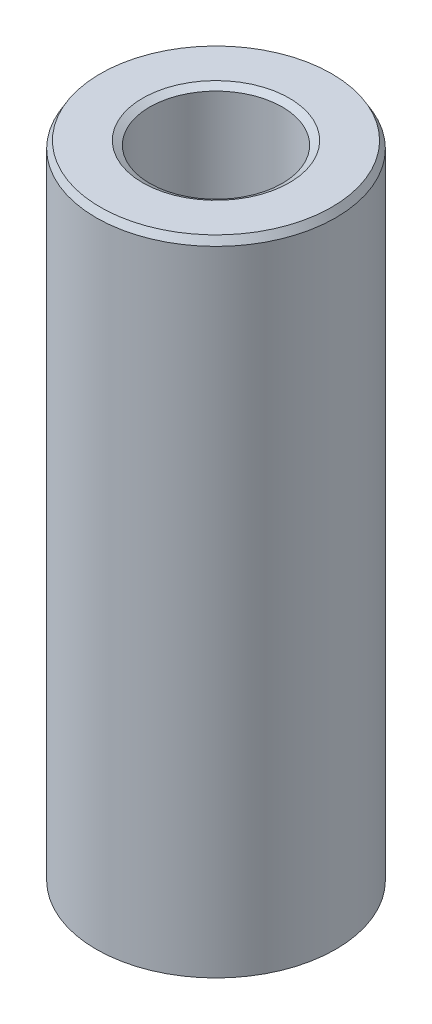
ISO-10303-21;
HEADER;
FILE_DESCRIPTION(('STEP AP214'),'2;1');
FILE_NAME('part.step','',(''),(''),'','','');
FILE_SCHEMA(('AUTOMOTIVE_DESIGN { 1 0 10303 214 1 1 1 1 }'));
ENDSEC;
DATA;
#1=APPLICATION_CONTEXT('core data for automotive mechanical design processes');
#2=APPLICATION_PROTOCOL_DEFINITION('international standard','automotive_design',2000,#1);
#3=PRODUCT_CONTEXT('',#1,'mechanical');
#4=PRODUCT('Part','Part','',(#3));
#5=PRODUCT_RELATED_PRODUCT_CATEGORY('part','',(#4));
#6=PRODUCT_DEFINITION_FORMATION('','',#4);
#7=PRODUCT_DEFINITION_CONTEXT('part definition',#1,'design');
#8=PRODUCT_DEFINITION('design','',#6,#7);
#9=PRODUCT_DEFINITION_SHAPE('','',#8);
#10=(LENGTH_UNIT() NAMED_UNIT(*) SI_UNIT(.MILLI.,.METRE.));
#11=(NAMED_UNIT(*) PLANE_ANGLE_UNIT() SI_UNIT($,.RADIAN.));
#12=(NAMED_UNIT(*) SI_UNIT($,.STERADIAN.) SOLID_ANGLE_UNIT());
#13=UNCERTAINTY_MEASURE_WITH_UNIT(LENGTH_MEASURE(1.E-05),#10,'distance_accuracy_value','');
#14=(GEOMETRIC_REPRESENTATION_CONTEXT(3) GLOBAL_UNCERTAINTY_ASSIGNED_CONTEXT((#13)) GLOBAL_UNIT_ASSIGNED_CONTEXT((#10,
#11,#12)) REPRESENTATION_CONTEXT('',''));
#15=CARTESIAN_POINT('',(0.,0.,0.));
#16=DIRECTION('',(0.,0.,1.));
#17=DIRECTION('',(1.,0.,0.));
#18=AXIS2_PLACEMENT_3D('',#15,#16,#17);
#19=CARTESIAN_POINT('',(0.,282.609990495539,0.));
#20=DIRECTION('',(0.,-1.,0.));
#21=DIRECTION('',(0.,0.,-1.));
#22=AXIS2_PLACEMENT_3D('',#19,#20,#21);
#23=CYLINDRICAL_SURFACE('',#22,52.5);
#24=CARTESIAN_POINT('',(0.,1.79233124902672,0.));
#25=DIRECTION('',(0.,1.,0.));
#26=DIRECTION('',(0.,0.,1.));
#27=AXIS2_PLACEMENT_3D('',#24,#25,#26);
#28=CIRCLE('',#27,52.5);
#29=CARTESIAN_POINT('',(0.,1.79233124902672,52.5));
#30=VERTEX_POINT('',#29);
#31=EDGE_CURVE('E10',#30,#30,#28,.T.);
#32=ORIENTED_EDGE('',*,*,#31,.T.);
#33=EDGE_LOOP('',(#32));
#34=FACE_BOUND('',#33,.T.);
#35=CARTESIAN_POINT('',(0.,279.505581708231,0.));
#36=DIRECTION('',(0.,1.,0.));
#37=DIRECTION('',(0.,0.,1.));
#38=AXIS2_PLACEMENT_3D('',#35,#36,#37);
#39=CIRCLE('',#38,52.5);
#40=CARTESIAN_POINT('',(0.,279.505581708231,-52.5));
#41=VERTEX_POINT('',#40);
#42=EDGE_CURVE('E50',#41,#41,#39,.F.);
#43=ORIENTED_EDGE('',*,*,#42,.T.);
#44=EDGE_LOOP('',(#43));
#45=FACE_BOUND('',#44,.T.);
#46=ADVANCED_FACE('F39',(#34,#45),#23,.T.);
#47=CARTESIAN_POINT('',(0.,282.609990495539,0.));
#48=DIRECTION('',(0.,1.,0.));
#49=DIRECTION('',(0.,0.,1.));
#50=AXIS2_PLACEMENT_3D('',#47,#48,#49);
#51=PLANE('',#50);
#52=CARTESIAN_POINT('',(0.,282.609990495539,0.));
#53=DIRECTION('',(0.,1.,0.));
#54=DIRECTION('',(0.,0.,1.));
#55=AXIS2_PLACEMENT_3D('',#52,#53,#54);
#56=CIRCLE('',#55,32.1462866020306);
#57=CARTESIAN_POINT('',(0.,282.609990495539,32.1462866020306));
#58=VERTEX_POINT('',#57);
#59=EDGE_CURVE('E58',#58,#58,#56,.F.);
#60=ORIENTED_EDGE('',*,*,#59,.T.);
#61=EDGE_LOOP('',(#60));
#62=FACE_BOUND('',#61,.T.);
#63=CARTESIAN_POINT('',(0.,282.609990495539,0.));
#64=DIRECTION('',(0.,1.,0.));
#65=DIRECTION('',(0.,0.,1.));
#66=AXIS2_PLACEMENT_3D('',#63,#64,#65);
#67=CIRCLE('',#66,50.7076687509733);
#68=CARTESIAN_POINT('',(0.,282.609990495539,-50.7076687509733));
#69=VERTEX_POINT('',#68);
#70=EDGE_CURVE('E61',#69,#69,#67,.T.);
#71=ORIENTED_EDGE('',*,*,#70,.T.);
#72=EDGE_LOOP('',(#71));
#73=FACE_BOUND('',#72,.T.);
#74=ADVANCED_FACE('F88',(#62,#73),#51,.T.);
#75=CARTESIAN_POINT('',(0.,0.,0.));
#76=DIRECTION('',(0.,1.,0.));
#77=DIRECTION('',(0.,0.,1.));
#78=AXIS2_PLACEMENT_3D('',#75,#76,#77);
#79=PLANE('',#78);
#80=CARTESIAN_POINT('',(0.,0.,0.));
#81=DIRECTION('',(0.,1.,0.));
#82=DIRECTION('',(0.,0.,1.));
#83=AXIS2_PLACEMENT_3D('',#80,#81,#82);
#84=CIRCLE('',#83,30.8342090637496);
#85=CARTESIAN_POINT('',(0.,0.,-30.8342090637496));
#86=VERTEX_POINT('',#85);
#87=EDGE_CURVE('E51',#86,#86,#84,.T.);
#88=ORIENTED_EDGE('',*,*,#87,.T.);
#89=EDGE_LOOP('',(#88));
#90=FACE_BOUND('',#89,.T.);
#91=CARTESIAN_POINT('',(0.,0.,0.));
#92=DIRECTION('',(0.,1.,0.));
#93=DIRECTION('',(0.,0.,1.));
#94=AXIS2_PLACEMENT_3D('',#91,#92,#93);
#95=CIRCLE('',#94,49.3955912126922);
#96=CARTESIAN_POINT('',(0.,0.,49.3955912126922));
#97=VERTEX_POINT('',#96);
#98=EDGE_CURVE('E54',#97,#97,#95,.F.);
#99=ORIENTED_EDGE('',*,*,#98,.T.);
#100=EDGE_LOOP('',(#99));
#101=FACE_BOUND('',#100,.T.);
#102=ADVANCED_FACE('F83',(#90,#101),#79,.F.);
#103=CARTESIAN_POINT('',(0.,282.609990495539,0.));
#104=DIRECTION('',(0.,-1.,0.));
#105=DIRECTION('',(0.,0.,-1.));
#106=AXIS2_PLACEMENT_3D('',#103,#104,#105);
#107=CYLINDRICAL_SURFACE('',#106,29.0418778147228);
#108=CARTESIAN_POINT('',(0.,280.817659246512,0.));
#109=DIRECTION('',(0.,1.,0.));
#110=DIRECTION('',(0.,0.,1.));
#111=AXIS2_PLACEMENT_3D('',#108,#109,#110);
#112=CIRCLE('',#111,29.0418778147228);
#113=CARTESIAN_POINT('',(0.,280.817659246512,29.0418778147228));
#114=VERTEX_POINT('',#113);
#115=EDGE_CURVE('E67',#114,#114,#112,.T.);
#116=ORIENTED_EDGE('',*,*,#115,.T.);
#117=EDGE_LOOP('',(#116));
#118=FACE_BOUND('',#117,.T.);
#119=CARTESIAN_POINT('',(0.,3.10440878730789,0.));
#120=DIRECTION('',(0.,1.,0.));
#121=DIRECTION('',(0.,0.,1.));
#122=AXIS2_PLACEMENT_3D('',#119,#120,#121);
#123=CIRCLE('',#122,29.0418778147228);
#124=CARTESIAN_POINT('',(0.,3.10440878730789,-29.0418778147228));
#125=VERTEX_POINT('',#124);
#126=EDGE_CURVE('E69',#125,#125,#123,.F.);
#127=ORIENTED_EDGE('',*,*,#126,.T.);
#128=EDGE_LOOP('',(#127));
#129=FACE_BOUND('',#128,.T.);
#130=ADVANCED_FACE('F71',(#118,#129),#107,.F.);
#131=CARTESIAN_POINT('',(0.,280.817659246512,0.));
#132=DIRECTION('',(0.,1.,0.));
#133=DIRECTION('',(0.,0.,1.));
#134=AXIS2_PLACEMENT_3D('',#131,#132,#133);
#135=CONICAL_SURFACE('',#134,29.0418778147228,1.04719755119659);
#136=ORIENTED_EDGE('',*,*,#59,.F.);
#137=EDGE_LOOP('',(#136));
#138=FACE_BOUND('',#137,.T.);
#139=ORIENTED_EDGE('',*,*,#115,.F.);
#140=EDGE_LOOP('',(#139));
#141=FACE_BOUND('',#140,.T.);
#142=ADVANCED_FACE('F77',(#138,#141),#135,.F.);
#143=CARTESIAN_POINT('',(0.,0.,0.));
#144=DIRECTION('',(0.,-1.,0.));
#145=DIRECTION('',(0.,0.,-1.));
#146=AXIS2_PLACEMENT_3D('',#143,#144,#145);
#147=CONICAL_SURFACE('',#146,30.8342090637496,0.523598775598301);
#148=CARTESIAN_POINT('',(0.,3.10440878730789,-29.0418778147228));
#149=CARTESIAN_POINT('',(0.,3.07207119577343,-29.0605479319002));
#150=CARTESIAN_POINT('',(0.,3.03973360423897,-29.0792180490775));
#151=CARTESIAN_POINT('',(0.,2.97505842117006,-29.1165582834322));
#152=CARTESIAN_POINT('',(0.,2.9427208296356,-29.1352284006096));
#153=CARTESIAN_POINT('',(0.,2.87804564656669,-29.1725686349643));
#154=CARTESIAN_POINT('',(0.,2.84570805503223,-29.1912387521417));
#155=CARTESIAN_POINT('',(0.,2.78103287196332,-29.2285789864964));
#156=CARTESIAN_POINT('',(0.,2.74869528042886,-29.2472491036738));
#157=CARTESIAN_POINT('',(0.,2.68402009735994,-29.2845893380285));
#158=CARTESIAN_POINT('',(0.,2.65168250582549,-29.3032594552059));
#159=CARTESIAN_POINT('',(0.,2.58700732275657,-29.3405996895606));
#160=CARTESIAN_POINT('',(0.,2.55466973122212,-29.359269806738));
#161=CARTESIAN_POINT('',(0.,2.4899945481532,-29.3966100410927));
#162=CARTESIAN_POINT('',(0.,2.45765695661874,-29.4152801582701));
#163=CARTESIAN_POINT('',(0.,2.39298177354983,-29.4526203926248));
#164=CARTESIAN_POINT('',(0.,2.36064418201537,-29.4712905098021));
#165=CARTESIAN_POINT('',(0.,2.29596899894646,-29.5086307441569));
#166=CARTESIAN_POINT('',(0.,2.263631407412,-29.5273008613342));
#167=CARTESIAN_POINT('',(0.,2.19895622434309,-29.564641095689));
#168=CARTESIAN_POINT('',(0.,2.16661863280863,-29.5833112128663));
#169=CARTESIAN_POINT('',(0.,2.10194344973972,-29.620651447221));
#170=CARTESIAN_POINT('',(0.,2.06960585820526,-29.6393215643984));
#171=CARTESIAN_POINT('',(0.,2.00493067513634,-29.6766617987531));
#172=CARTESIAN_POINT('',(0.,1.97259308360189,-29.6953319159305));
#173=CARTESIAN_POINT('',(0.,1.90791790053297,-29.7326721502852));
#174=CARTESIAN_POINT('',(0.,1.87558030899852,-29.7513422674626));
#175=CARTESIAN_POINT('',(0.,1.8109051259296,-29.7886825018173));
#176=CARTESIAN_POINT('',(0.,1.77856753439514,-29.8073526189947));
#177=CARTESIAN_POINT('',(0.,1.71389235132623,-29.8446928533494));
#178=CARTESIAN_POINT('',(0.,1.68155475979177,-29.8633629705268));
#179=CARTESIAN_POINT('',(0.,1.61687957672286,-29.9007032048815));
#180=CARTESIAN_POINT('',(0.,1.5845419851884,-29.9193733220589));
#181=CARTESIAN_POINT('',(0.,1.51986680211949,-29.9567135564136));
#182=CARTESIAN_POINT('',(0.,1.48752921058503,-29.9753836735909));
#183=CARTESIAN_POINT('',(0.,1.42285402751612,-30.0127239079457));
#184=CARTESIAN_POINT('',(0.,1.39051643598166,-30.031394025123));
#185=CARTESIAN_POINT('',(0.,1.32584125291274,-30.0687342594778));
#186=CARTESIAN_POINT('',(0.,1.29350366137829,-30.0874043766551));
#187=CARTESIAN_POINT('',(0.,1.22882847830937,-30.1247446110098));
#188=CARTESIAN_POINT('',(0.,1.19649088677492,-30.1434147281872));
#189=CARTESIAN_POINT('',(0.,1.131815703706,-30.1807549625419));
#190=CARTESIAN_POINT('',(0.,1.09947811217154,-30.1994250797193));
#191=CARTESIAN_POINT('',(0.,1.03480292910263,-30.236765314074));
#192=CARTESIAN_POINT('',(0.,1.00246533756817,-30.2554354312514));
#193=CARTESIAN_POINT('',(0.,0.937790154499258,-30.2927756656061));
#194=CARTESIAN_POINT('',(0.,0.905452562964801,-30.3114457827835));
#195=CARTESIAN_POINT('',(0.,0.840777379895886,-30.3487860171382));
#196=CARTESIAN_POINT('',(0.,0.808439788361429,-30.3674561343156));
#197=CARTESIAN_POINT('',(0.,0.743764605292515,-30.4047963686703));
#198=CARTESIAN_POINT('',(0.,0.711427013758058,-30.4234664858477));
#199=CARTESIAN_POINT('',(0.,0.646751830689143,-30.4608067202024));
#200=CARTESIAN_POINT('',(0.,0.614414239154686,-30.4794768373797));
#201=CARTESIAN_POINT('',(0.,0.549739056085772,-30.5168170717345));
#202=CARTESIAN_POINT('',(0.,0.517401464551315,-30.5354871889118));
#203=CARTESIAN_POINT('',(0.,0.452726281482401,-30.5728274232666));
#204=CARTESIAN_POINT('',(0.,0.420388689947943,-30.5914975404439));
#205=CARTESIAN_POINT('',(0.,0.355713506879029,-30.6288377747987));
#206=CARTESIAN_POINT('',(0.,0.323375915344571,-30.647507891976));
#207=CARTESIAN_POINT('',(0.,0.258700732275657,-30.6848481263307));
#208=CARTESIAN_POINT('',(0.,0.2263631407412,-30.7035182435081));
#209=CARTESIAN_POINT('',(0.,0.161687957672286,-30.7408584778628));
#210=CARTESIAN_POINT('',(0.,0.129350366137829,-30.7595285950402));
#211=CARTESIAN_POINT('',(0.,0.0646751830689139,-30.7968688293949));
#212=CARTESIAN_POINT('',(0.,0.0323375915344564,-30.8155389465723));
#213=CARTESIAN_POINT('',(0.,0.,-30.8342090637496));
#214=B_SPLINE_CURVE_WITH_KNOTS('',3,(#148,#149,#150,#151,#152,#153,#154,#155,#156,#157,#158,
#159,#160,#161,#162,#163,#164,#165,#166,#167,#168,#169,#170,#171,#172,#173,#174,#175,#176,#177,
#178,#179,#180,#181,#182,#183,#184,#185,#186,#187,#188,#189,#190,#191,#192,#193,#194,#195,#196,
#197,#198,#199,#200,#201,#202,#203,#204,#205,#206,#207,#208,#209,#210,#211,#212,#213),
.UNSPECIFIED.,.F.,.F.,(4,2,2,2,2,2,2,2,2,2,2,2,2,2,2,2,2,2,2,2,2,2,2,2,2,2,2,2,2,2,2,2,4),(0.,
0.112020703064179,0.224041406128356,0.336062109192534,0.448082812256713,0.56010351532089,
0.672124218385069,0.784144921449248,0.896165624513426,1.0081863275776,1.12020703064178,
1.23222773370596,1.34424843677014,1.45626913983432,1.5682898428985,1.68031054596267,
1.79233124902685,1.90435195209103,2.01637265515521,2.12839335821939,2.24041406128356,
2.35243476434774,2.46445546741192,2.5764761704761,2.68849687354028,2.80051757660445,
2.91253827966863,3.02455898273281,3.13657968579699,3.24860038886117,3.36062109192535,
3.47264179498952,3.5846624980537),.UNSPECIFIED.);
#215=EDGE_CURVE('BSEAM73',#125,#86,#214,.T.);
#216=ORIENTED_EDGE('',*,*,#126,.F.);
#217=ORIENTED_EDGE('',*,*,#87,.F.);
#218=ORIENTED_EDGE('',*,*,#215,.T.);
#219=ORIENTED_EDGE('',*,*,#215,.F.);
#220=EDGE_LOOP('',(#216,#218,#217,#219));
#221=FACE_BOUND('',#220,.T.);
#222=ADVANCED_FACE('F73',(#221),#147,.F.);
#223=CARTESIAN_POINT('',(0.,1.79233124902672,0.));
#224=DIRECTION('',(0.,1.,0.));
#225=DIRECTION('',(0.,0.,1.));
#226=AXIS2_PLACEMENT_3D('',#223,#224,#225);
#227=CONICAL_SURFACE('',#226,52.5,1.04719755119661);
#228=ORIENTED_EDGE('',*,*,#98,.F.);
#229=EDGE_LOOP('',(#228));
#230=FACE_BOUND('',#229,.T.);
#231=ORIENTED_EDGE('',*,*,#31,.F.);
#232=EDGE_LOOP('',(#231));
#233=FACE_BOUND('',#232,.T.);
#234=ADVANCED_FACE('F76',(#230,#233),#227,.T.);
#235=CARTESIAN_POINT('',(0.,282.609990495539,0.));
#236=DIRECTION('',(0.,-1.,0.));
#237=DIRECTION('',(0.,0.,-1.));
#238=AXIS2_PLACEMENT_3D('',#235,#236,#237);
#239=CONICAL_SURFACE('',#238,50.7076687509733,0.523598775598294);
#240=CARTESIAN_POINT('',(0.,279.505581708231,-52.5));
#241=CARTESIAN_POINT('',(0.,279.537919299766,-52.4813298828226));
#242=CARTESIAN_POINT('',(0.,279.5702568913,-52.4626597656453));
#243=CARTESIAN_POINT('',(0.,279.634932074369,-52.4253195312906));
#244=CARTESIAN_POINT('',(0.,279.667269665904,-52.4066494141132));
#245=CARTESIAN_POINT('',(0.,279.731944848973,-52.3693091797585));
#246=CARTESIAN_POINT('',(0.,279.764282440507,-52.3506390625811));
#247=CARTESIAN_POINT('',(0.,279.828957623576,-52.3132988282264));
#248=CARTESIAN_POINT('',(0.,279.86129521511,-52.294628711049));
#249=CARTESIAN_POINT('',(0.,279.925970398179,-52.2572884766943));
#250=CARTESIAN_POINT('',(0.,279.958307989714,-52.2386183595169));
#251=CARTESIAN_POINT('',(0.,280.022983172783,-52.2012781251622));
#252=CARTESIAN_POINT('',(0.,280.055320764317,-52.1826080079849));
#253=CARTESIAN_POINT('',(0.,280.119995947386,-52.1452677736301));
#254=CARTESIAN_POINT('',(0.,280.152333538921,-52.1265976564528));
#255=CARTESIAN_POINT('',(0.,280.217008721989,-52.0892574220981));
#256=CARTESIAN_POINT('',(0.,280.249346313524,-52.0705873049207));
#257=CARTESIAN_POINT('',(0.,280.314021496593,-52.033247070566));
#258=CARTESIAN_POINT('',(0.,280.346359088127,-52.0145769533886));
#259=CARTESIAN_POINT('',(0.,280.411034271196,-51.9772367190339));
#260=CARTESIAN_POINT('',(0.,280.443371862731,-51.9585666018565));
#261=CARTESIAN_POINT('',(0.,280.5080470458,-51.9212263675018));
#262=CARTESIAN_POINT('',(0.,280.540384637334,-51.9025562503244));
#263=CARTESIAN_POINT('',(0.,280.605059820403,-51.8652160159697));
#264=CARTESIAN_POINT('',(0.,280.637397411937,-51.8465458987924));
#265=CARTESIAN_POINT('',(0.,280.702072595006,-51.8092056644376));
#266=CARTESIAN_POINT('',(0.,280.734410186541,-51.7905355472603));
#267=CARTESIAN_POINT('',(0.,280.79908536961,-51.7531953129055));
#268=CARTESIAN_POINT('',(0.,280.831422961144,-51.7345251957282));
#269=CARTESIAN_POINT('',(0.,280.896098144213,-51.6971849613735));
#270=CARTESIAN_POINT('',(0.,280.928435735747,-51.6785148441961));
#271=CARTESIAN_POINT('',(0.,280.993110918816,-51.6411746098414));
#272=CARTESIAN_POINT('',(0.,281.025448510351,-51.622504492664));
#273=CARTESIAN_POINT('',(0.,281.09012369342,-51.5851642583093));
#274=CARTESIAN_POINT('',(0.,281.122461284954,-51.5664941411319));
#275=CARTESIAN_POINT('',(0.,281.187136468023,-51.5291539067772));
#276=CARTESIAN_POINT('',(0.,281.219474059558,-51.5104837895998));
#277=CARTESIAN_POINT('',(0.,281.284149242627,-51.4731435552451));
#278=CARTESIAN_POINT('',(0.,281.316486834161,-51.4544734380678));
#279=CARTESIAN_POINT('',(0.,281.38116201723,-51.417133203713));
#280=CARTESIAN_POINT('',(0.,281.413499608764,-51.3984630865357));
#281=CARTESIAN_POINT('',(0.,281.478174791833,-51.3611228521809));
#282=CARTESIAN_POINT('',(0.,281.510512383368,-51.3424527350036));
#283=CARTESIAN_POINT('',(0.,281.575187566437,-51.3051125006489));
#284=CARTESIAN_POINT('',(0.,281.607525157971,-51.2864423834715));
#285=CARTESIAN_POINT('',(0.,281.67220034104,-51.2491021491168));
#286=CARTESIAN_POINT('',(0.,281.704537932574,-51.2304320319394));
#287=CARTESIAN_POINT('',(0.,281.769213115643,-51.1930917975847));
#288=CARTESIAN_POINT('',(0.,281.801550707178,-51.1744216804073));
#289=CARTESIAN_POINT('',(0.,281.866225890247,-51.1370814460526));
#290=CARTESIAN_POINT('',(0.,281.898563481781,-51.1184113288752));
#291=CARTESIAN_POINT('',(0.,281.96323866485,-51.0810710945205));
#292=CARTESIAN_POINT('',(0.,281.995576256384,-51.0624009773432));
#293=CARTESIAN_POINT('',(0.,282.060251439453,-51.0250607429884));
#294=CARTESIAN_POINT('',(0.,282.092589030988,-51.0063906258111));
#295=CARTESIAN_POINT('',(0.,282.157264214057,-50.9690503914563));
#296=CARTESIAN_POINT('',(0.,282.189601805591,-50.950380274279));
#297=CARTESIAN_POINT('',(0.,282.25427698866,-50.9130400399243));
#298=CARTESIAN_POINT('',(0.,282.286614580195,-50.8943699227469));
#299=CARTESIAN_POINT('',(0.,282.351289763264,-50.8570296883922));
#300=CARTESIAN_POINT('',(0.,282.383627354798,-50.8383595712148));
#301=CARTESIAN_POINT('',(0.,282.448302537867,-50.8010193368601));
#302=CARTESIAN_POINT('',(0.,282.480640129401,-50.7823492196827));
#303=CARTESIAN_POINT('',(0.,282.54531531247,-50.745008985328));
#304=CARTESIAN_POINT('',(0.,282.577652904005,-50.7263388681506));
#305=CARTESIAN_POINT('',(0.,282.609990495539,-50.7076687509733));
#306=B_SPLINE_CURVE_WITH_KNOTS('',3,(#240,#241,#242,#243,#244,#245,#246,#247,#248,#249,#250,
#251,#252,#253,#254,#255,#256,#257,#258,#259,#260,#261,#262,#263,#264,#265,#266,#267,#268,#269,
#270,#271,#272,#273,#274,#275,#276,#277,#278,#279,#280,#281,#282,#283,#284,#285,#286,#287,#288,
#289,#290,#291,#292,#293,#294,#295,#296,#297,#298,#299,#300,#301,#302,#303,#304,#305),
.UNSPECIFIED.,.F.,.F.,(4,2,2,2,2,2,2,2,2,2,2,2,2,2,2,2,2,2,2,2,2,2,2,2,2,2,2,2,2,2,2,2,4),(0.,
0.11202070306419,0.224041406128381,0.336062109192523,0.448082812256716,0.560103515320859,
0.672124218385049,0.784144921449243,0.896165624513385,1.00818632757758,1.12020703064172,
1.23222773370591,1.3442484367701,1.45626913983424,1.56828984289844,1.68031054596258,
1.79233124902677,1.90435195209096,2.01637265515511,2.1283933582193,2.24041406128344,
2.35243476434763,2.46445546741182,2.57647617047596,2.68849687354015,2.8005175766043,
2.91253827966849,3.02455898273268,3.13657968579683,3.24860038886102,3.36062109192516,
3.47264179498935,3.58466249805354),.UNSPECIFIED.);
#307=EDGE_CURVE('BSEAM45',#41,#69,#306,.T.);
#308=ORIENTED_EDGE('',*,*,#42,.F.);
#309=ORIENTED_EDGE('',*,*,#70,.F.);
#310=ORIENTED_EDGE('',*,*,#307,.T.);
#311=ORIENTED_EDGE('',*,*,#307,.F.);
#312=EDGE_LOOP('',(#308,#310,#309,#311));
#313=FACE_BOUND('',#312,.T.);
#314=ADVANCED_FACE('F45',(#313),#239,.T.);
#315=CLOSED_SHELL('',(#46,#74,#102,#130,#142,#222,#234,#314));
#316=MANIFOLD_SOLID_BREP('B2',#315);
#317=ADVANCED_BREP_SHAPE_REPRESENTATION('',(#18,#316),#14);
#318=SHAPE_DEFINITION_REPRESENTATION(#9,#317);
ENDSEC;
END-ISO-10303-21;
